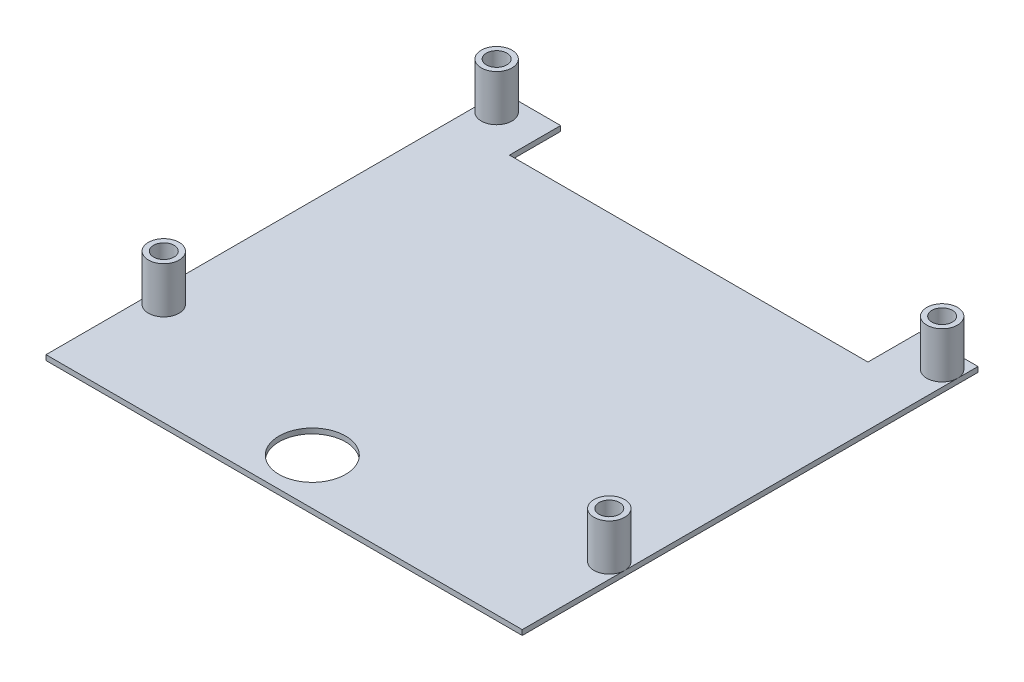
ISO-10303-21;
HEADER;
FILE_DESCRIPTION(('STEP AP214'),'2;1');
FILE_NAME('part.step','',(''),(''),'','','');
FILE_SCHEMA(('AUTOMOTIVE_DESIGN { 1 0 10303 214 1 1 1 1 }'));
ENDSEC;
DATA;
#1=APPLICATION_CONTEXT('core data for automotive mechanical design processes');
#2=APPLICATION_PROTOCOL_DEFINITION('international standard','automotive_design',2000,#1);
#3=PRODUCT_CONTEXT('',#1,'mechanical');
#4=PRODUCT('Part','Part','',(#3));
#5=PRODUCT_RELATED_PRODUCT_CATEGORY('part','',(#4));
#6=PRODUCT_DEFINITION_FORMATION('','',#4);
#7=PRODUCT_DEFINITION_CONTEXT('part definition',#1,'design');
#8=PRODUCT_DEFINITION('design','',#6,#7);
#9=PRODUCT_DEFINITION_SHAPE('','',#8);
#10=(LENGTH_UNIT() NAMED_UNIT(*) SI_UNIT(.MILLI.,.METRE.));
#11=(NAMED_UNIT(*) PLANE_ANGLE_UNIT() SI_UNIT($,.RADIAN.));
#12=(NAMED_UNIT(*) SI_UNIT($,.STERADIAN.) SOLID_ANGLE_UNIT());
#13=UNCERTAINTY_MEASURE_WITH_UNIT(LENGTH_MEASURE(1.E-05),#10,'distance_accuracy_value','');
#14=(GEOMETRIC_REPRESENTATION_CONTEXT(3) GLOBAL_UNCERTAINTY_ASSIGNED_CONTEXT((#13)) GLOBAL_UNIT_ASSIGNED_CONTEXT((#10,
#11,#12)) REPRESENTATION_CONTEXT('',''));
#15=CARTESIAN_POINT('',(0.,0.,0.));
#16=DIRECTION('',(0.,0.,1.));
#17=DIRECTION('',(1.,0.,0.));
#18=AXIS2_PLACEMENT_3D('',#15,#16,#17);
#19=CARTESIAN_POINT('',(-46.5,1.,-44.5));
#20=DIRECTION('',(0.,0.,1.));
#21=DIRECTION('',(1.,0.,0.));
#22=AXIS2_PLACEMENT_3D('',#19,#20,#21);
#23=PLANE('',#22);
#24=DIRECTION('',(-1.,0.,0.));
#25=VECTOR('',#24,1.);
#26=CARTESIAN_POINT('',(-46.5,1.,-44.5));
#27=LINE('',#26,#25);
#28=CARTESIAN_POINT('',(-35.,1.,-44.5));
#29=VERTEX_POINT('',#28);
#30=CARTESIAN_POINT('',(-46.5,1.,-44.5));
#31=VERTEX_POINT('',#30);
#32=EDGE_CURVE('E139',#29,#31,#27,.T.);
#33=ORIENTED_EDGE('',*,*,#32,.F.);
#34=DIRECTION('',(0.,1.,0.));
#35=VECTOR('',#34,1.);
#36=CARTESIAN_POINT('',(-35.,0.,-44.5));
#37=LINE('',#36,#35);
#38=CARTESIAN_POINT('',(-35.,0.,-44.5));
#39=VERTEX_POINT('',#38);
#40=EDGE_CURVE('E125',#39,#29,#37,.T.);
#41=ORIENTED_EDGE('',*,*,#40,.F.);
#42=DIRECTION('',(-1.,0.,0.));
#43=VECTOR('',#42,1.);
#44=CARTESIAN_POINT('',(-46.5,0.,-44.5));
#45=LINE('',#44,#43);
#46=CARTESIAN_POINT('',(-46.5,0.,-44.5));
#47=VERTEX_POINT('',#46);
#48=EDGE_CURVE('E164',#39,#47,#45,.T.);
#49=ORIENTED_EDGE('',*,*,#48,.T.);
#50=DIRECTION('',(0.,-1.,0.));
#51=VECTOR('',#50,1.);
#52=CARTESIAN_POINT('',(-46.5,1.,-44.5));
#53=LINE('',#52,#51);
#54=EDGE_CURVE('E46',#31,#47,#53,.T.);
#55=ORIENTED_EDGE('',*,*,#54,.F.);
#56=EDGE_LOOP('',(#33,#41,#49,#55));
#57=FACE_BOUND('',#56,.T.);
#58=ADVANCED_FACE('F38',(#57),#23,.F.);
#59=CARTESIAN_POINT('',(46.5,1.,44.5));
#60=DIRECTION('',(-1.,0.,0.));
#61=DIRECTION('',(0.,0.,1.));
#62=AXIS2_PLACEMENT_3D('',#59,#60,#61);
#63=PLANE('',#62);
#64=DIRECTION('',(0.,0.,-1.));
#65=VECTOR('',#64,1.);
#66=CARTESIAN_POINT('',(46.5,0.,44.5));
#67=LINE('',#66,#65);
#68=CARTESIAN_POINT('',(46.5,0.,44.5));
#69=VERTEX_POINT('',#68);
#70=CARTESIAN_POINT('',(46.5,0.,-44.5));
#71=VERTEX_POINT('',#70);
#72=EDGE_CURVE('E161',#69,#71,#67,.T.);
#73=ORIENTED_EDGE('',*,*,#72,.T.);
#74=DIRECTION('',(0.,-1.,0.));
#75=VECTOR('',#74,1.);
#76=CARTESIAN_POINT('',(46.5,1.,-44.5));
#77=LINE('',#76,#75);
#78=CARTESIAN_POINT('',(46.5,1.,-44.5));
#79=VERTEX_POINT('',#78);
#80=EDGE_CURVE('E11',#79,#71,#77,.T.);
#81=ORIENTED_EDGE('',*,*,#80,.F.);
#82=DIRECTION('',(0.,0.,-1.));
#83=VECTOR('',#82,1.);
#84=CARTESIAN_POINT('',(46.5,1.,44.5));
#85=LINE('',#84,#83);
#86=CARTESIAN_POINT('',(46.5,1.,-40.5));
#87=VERTEX_POINT('',#86);
#88=EDGE_CURVE('E90',#87,#79,#85,.T.);
#89=ORIENTED_EDGE('',*,*,#88,.F.);
#90=CARTESIAN_POINT('',(46.5,1.,24.5));
#91=VERTEX_POINT('',#90);
#92=EDGE_CURVE('E152',#91,#87,#85,.T.);
#93=ORIENTED_EDGE('',*,*,#92,.F.);
#94=CARTESIAN_POINT('',(46.5,1.,44.5));
#95=VERTEX_POINT('',#94);
#96=EDGE_CURVE('E149',#95,#91,#85,.T.);
#97=ORIENTED_EDGE('',*,*,#96,.F.);
#98=DIRECTION('',(0.,-1.,0.));
#99=VECTOR('',#98,1.);
#100=CARTESIAN_POINT('',(46.5,1.,44.5));
#101=LINE('',#100,#99);
#102=EDGE_CURVE('E160',#95,#69,#101,.T.);
#103=ORIENTED_EDGE('',*,*,#102,.T.);
#104=EDGE_LOOP('',(#73,#81,#89,#93,#97,#103));
#105=FACE_BOUND('',#104,.T.);
#106=ADVANCED_FACE('F40',(#105),#63,.F.);
#107=CARTESIAN_POINT('',(35.,0.,-44.5));
#108=VERTEX_POINT('',#107);
#109=EDGE_CURVE('E166',#71,#108,#45,.T.);
#110=ORIENTED_EDGE('',*,*,#109,.T.);
#111=DIRECTION('',(0.,1.,0.));
#112=VECTOR('',#111,1.);
#113=CARTESIAN_POINT('',(35.,0.,-44.5));
#114=LINE('',#113,#112);
#115=CARTESIAN_POINT('',(35.,1.,-44.5));
#116=VERTEX_POINT('',#115);
#117=EDGE_CURVE('E135',#108,#116,#114,.T.);
#118=ORIENTED_EDGE('',*,*,#117,.T.);
#119=EDGE_CURVE('E148',#79,#116,#27,.T.);
#120=ORIENTED_EDGE('',*,*,#119,.F.);
#121=ORIENTED_EDGE('',*,*,#80,.T.);
#122=EDGE_LOOP('',(#110,#118,#120,#121));
#123=FACE_BOUND('',#122,.T.);
#124=ADVANCED_FACE('F229',(#123),#23,.F.);
#125=CARTESIAN_POINT('',(-46.5,1.,44.5));
#126=DIRECTION('',(1.,0.,0.));
#127=DIRECTION('',(0.,0.,-1.));
#128=AXIS2_PLACEMENT_3D('',#125,#126,#127);
#129=PLANE('',#128);
#130=DIRECTION('',(0.,0.,1.));
#131=VECTOR('',#130,1.);
#132=CARTESIAN_POINT('',(-46.5,0.,44.5));
#133=LINE('',#132,#131);
#134=CARTESIAN_POINT('',(-46.5,0.,44.5));
#135=VERTEX_POINT('',#134);
#136=EDGE_CURVE('E169',#47,#135,#133,.T.);
#137=ORIENTED_EDGE('',*,*,#136,.T.);
#138=DIRECTION('',(0.,-1.,0.));
#139=VECTOR('',#138,1.);
#140=CARTESIAN_POINT('',(-46.5,1.,44.5));
#141=LINE('',#140,#139);
#142=CARTESIAN_POINT('',(-46.5,1.,44.5));
#143=VERTEX_POINT('',#142);
#144=EDGE_CURVE('E173',#143,#135,#141,.T.);
#145=ORIENTED_EDGE('',*,*,#144,.F.);
#146=DIRECTION('',(0.,0.,1.));
#147=VECTOR('',#146,1.);
#148=CARTESIAN_POINT('',(-46.5,1.,44.5));
#149=LINE('',#148,#147);
#150=CARTESIAN_POINT('',(-46.5,1.,24.5));
#151=VERTEX_POINT('',#150);
#152=EDGE_CURVE('E151',#151,#143,#149,.T.);
#153=ORIENTED_EDGE('',*,*,#152,.F.);
#154=CARTESIAN_POINT('',(-46.5,1.,-40.5));
#155=VERTEX_POINT('',#154);
#156=EDGE_CURVE('E158',#155,#151,#149,.T.);
#157=ORIENTED_EDGE('',*,*,#156,.F.);
#158=EDGE_CURVE('E156',#31,#155,#149,.T.);
#159=ORIENTED_EDGE('',*,*,#158,.F.);
#160=ORIENTED_EDGE('',*,*,#54,.T.);
#161=EDGE_LOOP('',(#137,#145,#153,#157,#159,#160));
#162=FACE_BOUND('',#161,.T.);
#163=ADVANCED_FACE('F176',(#162),#129,.F.);
#164=CARTESIAN_POINT('',(-46.5,1.,44.5));
#165=DIRECTION('',(0.,0.,-1.));
#166=DIRECTION('',(-1.,0.,0.));
#167=AXIS2_PLACEMENT_3D('',#164,#165,#166);
#168=PLANE('',#167);
#169=DIRECTION('',(1.,0.,0.));
#170=VECTOR('',#169,1.);
#171=CARTESIAN_POINT('',(-46.5,0.,44.5));
#172=LINE('',#171,#170);
#173=EDGE_CURVE('E83',#135,#69,#172,.T.);
#174=ORIENTED_EDGE('',*,*,#173,.T.);
#175=ORIENTED_EDGE('',*,*,#102,.F.);
#176=DIRECTION('',(1.,0.,0.));
#177=VECTOR('',#176,1.);
#178=CARTESIAN_POINT('',(-46.5,1.,44.5));
#179=LINE('',#178,#177);
#180=EDGE_CURVE('E62',#143,#95,#179,.T.);
#181=ORIENTED_EDGE('',*,*,#180,.F.);
#182=ORIENTED_EDGE('',*,*,#144,.T.);
#183=EDGE_LOOP('',(#174,#175,#181,#182));
#184=FACE_BOUND('',#183,.T.);
#185=ADVANCED_FACE('F186',(#184),#168,.F.);
#186=CARTESIAN_POINT('',(0.,1.,0.));
#187=DIRECTION('',(0.,-1.,0.));
#188=DIRECTION('',(0.,0.,-1.));
#189=AXIS2_PLACEMENT_3D('',#186,#187,#188);
#190=PLANE('',#189);
#191=CARTESIAN_POINT('',(-3.50000000000001,1.,35.5));
#192=DIRECTION('',(0.,1.,0.));
#193=DIRECTION('',(0.,0.,1.));
#194=AXIS2_PLACEMENT_3D('',#191,#192,#193);
#195=CIRCLE('',#194,6.5);
#196=CARTESIAN_POINT('',(-3.50000000000001,1.,42.));
#197=VERTEX_POINT('',#196);
#198=EDGE_CURVE('E144',#197,#197,#195,.T.);
#199=ORIENTED_EDGE('',*,*,#198,.F.);
#200=EDGE_LOOP('',(#199));
#201=FACE_BOUND('',#200,.T.);
#202=DIRECTION('',(1.,0.,0.));
#203=VECTOR('',#202,1.);
#204=CARTESIAN_POINT('',(-35.,1.,-34.5));
#205=LINE('',#204,#203);
#206=CARTESIAN_POINT('',(-35.,1.,-34.5));
#207=VERTEX_POINT('',#206);
#208=CARTESIAN_POINT('',(35.,1.,-34.5));
#209=VERTEX_POINT('',#208);
#210=EDGE_CURVE('E143',#207,#209,#205,.T.);
#211=ORIENTED_EDGE('',*,*,#210,.F.);
#212=DIRECTION('',(0.,0.,1.));
#213=VECTOR('',#212,1.);
#214=CARTESIAN_POINT('',(-35.,1.,-34.5));
#215=LINE('',#214,#213);
#216=EDGE_CURVE('E128',#29,#207,#215,.T.);
#217=ORIENTED_EDGE('',*,*,#216,.F.);
#218=ORIENTED_EDGE('',*,*,#32,.T.);
#219=ORIENTED_EDGE('',*,*,#158,.T.);
#220=CARTESIAN_POINT('',(-43.5,1.,-40.5));
#221=DIRECTION('',(0.,1.,0.));
#222=DIRECTION('',(0.,0.,1.));
#223=AXIS2_PLACEMENT_3D('',#220,#221,#222);
#224=CIRCLE('',#223,3.);
#225=EDGE_CURVE('E207',#155,#155,#224,.T.);
#226=ORIENTED_EDGE('',*,*,#225,.F.);
#227=ORIENTED_EDGE('',*,*,#156,.T.);
#228=CARTESIAN_POINT('',(-43.5,1.,24.5));
#229=DIRECTION('',(0.,1.,0.));
#230=DIRECTION('',(0.,0.,1.));
#231=AXIS2_PLACEMENT_3D('',#228,#229,#230);
#232=CIRCLE('',#231,3.);
#233=EDGE_CURVE('E191',#151,#151,#232,.T.);
#234=ORIENTED_EDGE('',*,*,#233,.F.);
#235=ORIENTED_EDGE('',*,*,#152,.T.);
#236=ORIENTED_EDGE('',*,*,#180,.T.);
#237=ORIENTED_EDGE('',*,*,#96,.T.);
#238=CARTESIAN_POINT('',(43.5,1.,24.5));
#239=DIRECTION('',(0.,1.,0.));
#240=DIRECTION('',(0.,0.,1.));
#241=AXIS2_PLACEMENT_3D('',#238,#239,#240);
#242=CIRCLE('',#241,3.);
#243=EDGE_CURVE('E200',#91,#91,#242,.T.);
#244=ORIENTED_EDGE('',*,*,#243,.F.);
#245=ORIENTED_EDGE('',*,*,#92,.T.);
#246=CARTESIAN_POINT('',(43.5,1.,-40.5));
#247=DIRECTION('',(0.,1.,0.));
#248=DIRECTION('',(0.,0.,1.));
#249=AXIS2_PLACEMENT_3D('',#246,#247,#248);
#250=CIRCLE('',#249,3.);
#251=EDGE_CURVE('E197',#87,#87,#250,.T.);
#252=ORIENTED_EDGE('',*,*,#251,.F.);
#253=ORIENTED_EDGE('',*,*,#88,.T.);
#254=ORIENTED_EDGE('',*,*,#119,.T.);
#255=DIRECTION('',(0.,0.,-1.));
#256=VECTOR('',#255,1.);
#257=CARTESIAN_POINT('',(35.,1.,-34.5));
#258=LINE('',#257,#256);
#259=EDGE_CURVE('E240',#209,#116,#258,.T.);
#260=ORIENTED_EDGE('',*,*,#259,.F.);
#261=EDGE_LOOP('',(#211,#217,#218,#219,#226,#227,#234,#235,#236,#237,#244,#245,#252,#253,#254,#260));
#262=FACE_BOUND('',#261,.T.);
#263=ADVANCED_FACE('F138',(#201,#262),#190,.F.);
#264=CARTESIAN_POINT('',(0.,0.,0.));
#265=DIRECTION('',(0.,-1.,0.));
#266=DIRECTION('',(0.,0.,-1.));
#267=AXIS2_PLACEMENT_3D('',#264,#265,#266);
#268=PLANE('',#267);
#269=CARTESIAN_POINT('',(-43.5,0.,24.5));
#270=DIRECTION('',(0.,1.,0.));
#271=DIRECTION('',(0.,0.,1.));
#272=AXIS2_PLACEMENT_3D('',#269,#270,#271);
#273=CIRCLE('',#272,2.);
#274=CARTESIAN_POINT('',(-43.5,0.,26.5));
#275=VERTEX_POINT('',#274);
#276=EDGE_CURVE('E317',#275,#275,#273,.T.);
#277=ORIENTED_EDGE('',*,*,#276,.T.);
#278=EDGE_LOOP('',(#277));
#279=FACE_BOUND('',#278,.T.);
#280=CARTESIAN_POINT('',(43.5,0.,-40.5));
#281=DIRECTION('',(0.,1.,0.));
#282=DIRECTION('',(0.,0.,1.));
#283=AXIS2_PLACEMENT_3D('',#280,#281,#282);
#284=CIRCLE('',#283,2.);
#285=CARTESIAN_POINT('',(43.5,0.,-38.5));
#286=VERTEX_POINT('',#285);
#287=EDGE_CURVE('E318',#286,#286,#284,.T.);
#288=ORIENTED_EDGE('',*,*,#287,.T.);
#289=EDGE_LOOP('',(#288));
#290=FACE_BOUND('',#289,.T.);
#291=CARTESIAN_POINT('',(43.5,0.,24.5));
#292=DIRECTION('',(0.,1.,0.));
#293=DIRECTION('',(0.,0.,1.));
#294=AXIS2_PLACEMENT_3D('',#291,#292,#293);
#295=CIRCLE('',#294,2.);
#296=CARTESIAN_POINT('',(43.5,0.,26.5));
#297=VERTEX_POINT('',#296);
#298=EDGE_CURVE('E337',#297,#297,#295,.T.);
#299=ORIENTED_EDGE('',*,*,#298,.T.);
#300=EDGE_LOOP('',(#299));
#301=FACE_BOUND('',#300,.T.);
#302=CARTESIAN_POINT('',(-43.5,0.,-40.5));
#303=DIRECTION('',(0.,1.,0.));
#304=DIRECTION('',(0.,0.,1.));
#305=AXIS2_PLACEMENT_3D('',#302,#303,#304);
#306=CIRCLE('',#305,2.);
#307=CARTESIAN_POINT('',(-43.5,0.,-38.5));
#308=VERTEX_POINT('',#307);
#309=EDGE_CURVE('E136',#308,#308,#306,.T.);
#310=ORIENTED_EDGE('',*,*,#309,.T.);
#311=EDGE_LOOP('',(#310));
#312=FACE_BOUND('',#311,.T.);
#313=CARTESIAN_POINT('',(-3.50000000000001,0.,35.5));
#314=DIRECTION('',(0.,1.,0.));
#315=DIRECTION('',(0.,0.,1.));
#316=AXIS2_PLACEMENT_3D('',#313,#314,#315);
#317=CIRCLE('',#316,6.5);
#318=CARTESIAN_POINT('',(-3.50000000000001,0.,42.));
#319=VERTEX_POINT('',#318);
#320=EDGE_CURVE('E254',#319,#319,#317,.T.);
#321=ORIENTED_EDGE('',*,*,#320,.T.);
#322=EDGE_LOOP('',(#321));
#323=FACE_BOUND('',#322,.T.);
#324=DIRECTION('',(0.,0.,1.));
#325=VECTOR('',#324,1.);
#326=CARTESIAN_POINT('',(-35.,0.,-34.5));
#327=LINE('',#326,#325);
#328=CARTESIAN_POINT('',(-35.,0.,-34.5));
#329=VERTEX_POINT('',#328);
#330=EDGE_CURVE('E131',#39,#329,#327,.T.);
#331=ORIENTED_EDGE('',*,*,#330,.T.);
#332=DIRECTION('',(1.,0.,0.));
#333=VECTOR('',#332,1.);
#334=CARTESIAN_POINT('',(-35.,0.,-34.5));
#335=LINE('',#334,#333);
#336=CARTESIAN_POINT('',(35.,0.,-34.5));
#337=VERTEX_POINT('',#336);
#338=EDGE_CURVE('E243',#329,#337,#335,.T.);
#339=ORIENTED_EDGE('',*,*,#338,.T.);
#340=DIRECTION('',(0.,0.,-1.));
#341=VECTOR('',#340,1.);
#342=CARTESIAN_POINT('',(35.,0.,-34.5));
#343=LINE('',#342,#341);
#344=EDGE_CURVE('E53',#337,#108,#343,.T.);
#345=ORIENTED_EDGE('',*,*,#344,.T.);
#346=ORIENTED_EDGE('',*,*,#109,.F.);
#347=ORIENTED_EDGE('',*,*,#72,.F.);
#348=ORIENTED_EDGE('',*,*,#173,.F.);
#349=ORIENTED_EDGE('',*,*,#136,.F.);
#350=ORIENTED_EDGE('',*,*,#48,.F.);
#351=EDGE_LOOP('',(#331,#339,#345,#346,#347,#348,#349,#350));
#352=FACE_BOUND('',#351,.T.);
#353=ADVANCED_FACE('F180',(#279,#290,#301,#312,#323,#352),#268,.T.);
#354=CARTESIAN_POINT('',(-43.5,10.,-40.5));
#355=DIRECTION('',(0.,-1.,0.));
#356=DIRECTION('',(0.,0.,-1.));
#357=AXIS2_PLACEMENT_3D('',#354,#355,#356);
#358=CYLINDRICAL_SURFACE('',#357,3.);
#359=CARTESIAN_POINT('',(-43.5,10.,-40.5));
#360=DIRECTION('',(0.,1.,0.));
#361=DIRECTION('',(0.,0.,1.));
#362=AXIS2_PLACEMENT_3D('',#359,#360,#361);
#363=CIRCLE('',#362,3.);
#364=CARTESIAN_POINT('',(-43.5,10.,-37.5));
#365=VERTEX_POINT('',#364);
#366=EDGE_CURVE('E165',#365,#365,#363,.T.);
#367=ORIENTED_EDGE('',*,*,#366,.F.);
#368=EDGE_LOOP('',(#367));
#369=FACE_BOUND('',#368,.T.);
#370=ORIENTED_EDGE('',*,*,#225,.T.);
#371=EDGE_LOOP('',(#370));
#372=FACE_BOUND('',#371,.T.);
#373=ADVANCED_FACE('F212',(#369,#372),#358,.T.);
#374=CARTESIAN_POINT('',(-43.5,10.,-40.5));
#375=DIRECTION('',(0.,1.,0.));
#376=DIRECTION('',(0.,0.,1.));
#377=AXIS2_PLACEMENT_3D('',#374,#375,#376);
#378=PLANE('',#377);
#379=CARTESIAN_POINT('',(-43.5,10.,-40.5));
#380=DIRECTION('',(0.,1.,0.));
#381=DIRECTION('',(0.,0.,1.));
#382=AXIS2_PLACEMENT_3D('',#379,#380,#381);
#383=CIRCLE('',#382,2.);
#384=CARTESIAN_POINT('',(-43.5,10.,-38.5));
#385=VERTEX_POINT('',#384);
#386=EDGE_CURVE('E264',#385,#385,#383,.T.);
#387=ORIENTED_EDGE('',*,*,#386,.F.);
#388=EDGE_LOOP('',(#387));
#389=FACE_BOUND('',#388,.T.);
#390=ORIENTED_EDGE('',*,*,#366,.T.);
#391=EDGE_LOOP('',(#390));
#392=FACE_BOUND('',#391,.T.);
#393=ADVANCED_FACE('F214',(#389,#392),#378,.T.);
#394=CARTESIAN_POINT('',(43.5,10.,-40.5));
#395=DIRECTION('',(0.,-1.,0.));
#396=DIRECTION('',(0.,0.,-1.));
#397=AXIS2_PLACEMENT_3D('',#394,#395,#396);
#398=CYLINDRICAL_SURFACE('',#397,3.);
#399=CARTESIAN_POINT('',(43.5,10.,-40.5));
#400=DIRECTION('',(0.,1.,0.));
#401=DIRECTION('',(0.,0.,1.));
#402=AXIS2_PLACEMENT_3D('',#399,#400,#401);
#403=CIRCLE('',#402,3.);
#404=CARTESIAN_POINT('',(43.5,10.,-37.5));
#405=VERTEX_POINT('',#404);
#406=EDGE_CURVE('E193',#405,#405,#403,.T.);
#407=ORIENTED_EDGE('',*,*,#406,.F.);
#408=EDGE_LOOP('',(#407));
#409=FACE_BOUND('',#408,.T.);
#410=ORIENTED_EDGE('',*,*,#251,.T.);
#411=EDGE_LOOP('',(#410));
#412=FACE_BOUND('',#411,.T.);
#413=ADVANCED_FACE('F221',(#409,#412),#398,.T.);
#414=CARTESIAN_POINT('',(43.5,10.,-40.5));
#415=DIRECTION('',(0.,1.,0.));
#416=DIRECTION('',(0.,0.,1.));
#417=AXIS2_PLACEMENT_3D('',#414,#415,#416);
#418=PLANE('',#417);
#419=CARTESIAN_POINT('',(43.5,10.,-40.5));
#420=DIRECTION('',(0.,1.,0.));
#421=DIRECTION('',(0.,0.,1.));
#422=AXIS2_PLACEMENT_3D('',#419,#420,#421);
#423=CIRCLE('',#422,2.);
#424=CARTESIAN_POINT('',(43.5,10.,-38.5));
#425=VERTEX_POINT('',#424);
#426=EDGE_CURVE('E313',#425,#425,#423,.T.);
#427=ORIENTED_EDGE('',*,*,#426,.F.);
#428=EDGE_LOOP('',(#427));
#429=FACE_BOUND('',#428,.T.);
#430=ORIENTED_EDGE('',*,*,#406,.T.);
#431=EDGE_LOOP('',(#430));
#432=FACE_BOUND('',#431,.T.);
#433=ADVANCED_FACE('F298',(#429,#432),#418,.T.);
#434=CARTESIAN_POINT('',(-43.5,10.,24.5));
#435=DIRECTION('',(0.,-1.,0.));
#436=DIRECTION('',(0.,0.,-1.));
#437=AXIS2_PLACEMENT_3D('',#434,#435,#436);
#438=CYLINDRICAL_SURFACE('',#437,3.);
#439=CARTESIAN_POINT('',(-43.5,10.,24.5));
#440=DIRECTION('',(0.,1.,0.));
#441=DIRECTION('',(0.,0.,1.));
#442=AXIS2_PLACEMENT_3D('',#439,#440,#441);
#443=CIRCLE('',#442,3.);
#444=CARTESIAN_POINT('',(-43.5,10.,27.5));
#445=VERTEX_POINT('',#444);
#446=EDGE_CURVE('E194',#445,#445,#443,.T.);
#447=ORIENTED_EDGE('',*,*,#446,.F.);
#448=EDGE_LOOP('',(#447));
#449=FACE_BOUND('',#448,.T.);
#450=ORIENTED_EDGE('',*,*,#233,.T.);
#451=EDGE_LOOP('',(#450));
#452=FACE_BOUND('',#451,.T.);
#453=ADVANCED_FACE('F295',(#449,#452),#438,.T.);
#454=CARTESIAN_POINT('',(-43.5,10.,24.5));
#455=DIRECTION('',(0.,1.,0.));
#456=DIRECTION('',(0.,0.,1.));
#457=AXIS2_PLACEMENT_3D('',#454,#455,#456);
#458=PLANE('',#457);
#459=CARTESIAN_POINT('',(-43.5,10.,24.5));
#460=DIRECTION('',(0.,1.,0.));
#461=DIRECTION('',(0.,0.,1.));
#462=AXIS2_PLACEMENT_3D('',#459,#460,#461);
#463=CIRCLE('',#462,2.);
#464=CARTESIAN_POINT('',(-43.5,10.,26.5));
#465=VERTEX_POINT('',#464);
#466=EDGE_CURVE('E321',#465,#465,#463,.T.);
#467=ORIENTED_EDGE('',*,*,#466,.F.);
#468=EDGE_LOOP('',(#467));
#469=FACE_BOUND('',#468,.T.);
#470=ORIENTED_EDGE('',*,*,#446,.T.);
#471=EDGE_LOOP('',(#470));
#472=FACE_BOUND('',#471,.T.);
#473=ADVANCED_FACE('F290',(#469,#472),#458,.T.);
#474=CARTESIAN_POINT('',(43.5,10.,24.5));
#475=DIRECTION('',(0.,-1.,0.));
#476=DIRECTION('',(0.,0.,-1.));
#477=AXIS2_PLACEMENT_3D('',#474,#475,#476);
#478=CYLINDRICAL_SURFACE('',#477,3.);
#479=CARTESIAN_POINT('',(43.5,10.,24.5));
#480=DIRECTION('',(0.,1.,0.));
#481=DIRECTION('',(0.,0.,1.));
#482=AXIS2_PLACEMENT_3D('',#479,#480,#481);
#483=CIRCLE('',#482,3.);
#484=CARTESIAN_POINT('',(43.5,10.,27.5));
#485=VERTEX_POINT('',#484);
#486=EDGE_CURVE('E203',#485,#485,#483,.T.);
#487=ORIENTED_EDGE('',*,*,#486,.F.);
#488=EDGE_LOOP('',(#487));
#489=FACE_BOUND('',#488,.T.);
#490=ORIENTED_EDGE('',*,*,#243,.T.);
#491=EDGE_LOOP('',(#490));
#492=FACE_BOUND('',#491,.T.);
#493=ADVANCED_FACE('F286',(#489,#492),#478,.T.);
#494=CARTESIAN_POINT('',(43.5,10.,24.5));
#495=DIRECTION('',(0.,1.,0.));
#496=DIRECTION('',(0.,0.,1.));
#497=AXIS2_PLACEMENT_3D('',#494,#495,#496);
#498=PLANE('',#497);
#499=CARTESIAN_POINT('',(43.5,10.,24.5));
#500=DIRECTION('',(0.,1.,0.));
#501=DIRECTION('',(0.,0.,1.));
#502=AXIS2_PLACEMENT_3D('',#499,#500,#501);
#503=CIRCLE('',#502,2.);
#504=CARTESIAN_POINT('',(43.5,10.,26.5));
#505=VERTEX_POINT('',#504);
#506=EDGE_CURVE('E324',#505,#505,#503,.T.);
#507=ORIENTED_EDGE('',*,*,#506,.F.);
#508=EDGE_LOOP('',(#507));
#509=FACE_BOUND('',#508,.T.);
#510=ORIENTED_EDGE('',*,*,#486,.T.);
#511=EDGE_LOOP('',(#510));
#512=FACE_BOUND('',#511,.T.);
#513=ADVANCED_FACE('F289',(#509,#512),#498,.T.);
#514=CARTESIAN_POINT('',(-35.,0.,-34.5));
#515=DIRECTION('',(-1.,0.,0.));
#516=DIRECTION('',(0.,0.,1.));
#517=AXIS2_PLACEMENT_3D('',#514,#515,#516);
#518=PLANE('',#517);
#519=ORIENTED_EDGE('',*,*,#216,.T.);
#520=DIRECTION('',(0.,1.,0.));
#521=VECTOR('',#520,1.);
#522=CARTESIAN_POINT('',(-35.,0.,-34.5));
#523=LINE('',#522,#521);
#524=EDGE_CURVE('E248',#329,#207,#523,.T.);
#525=ORIENTED_EDGE('',*,*,#524,.F.);
#526=ORIENTED_EDGE('',*,*,#330,.F.);
#527=ORIENTED_EDGE('',*,*,#40,.T.);
#528=EDGE_LOOP('',(#519,#525,#526,#527));
#529=FACE_BOUND('',#528,.T.);
#530=ADVANCED_FACE('F127',(#529),#518,.F.);
#531=CARTESIAN_POINT('',(35.,0.,-34.5));
#532=DIRECTION('',(1.,0.,0.));
#533=DIRECTION('',(0.,0.,-1.));
#534=AXIS2_PLACEMENT_3D('',#531,#532,#533);
#535=PLANE('',#534);
#536=ORIENTED_EDGE('',*,*,#259,.T.);
#537=ORIENTED_EDGE('',*,*,#117,.F.);
#538=ORIENTED_EDGE('',*,*,#344,.F.);
#539=DIRECTION('',(0.,1.,0.));
#540=VECTOR('',#539,1.);
#541=CARTESIAN_POINT('',(35.,0.,-34.5));
#542=LINE('',#541,#540);
#543=EDGE_CURVE('E268',#337,#209,#542,.T.);
#544=ORIENTED_EDGE('',*,*,#543,.T.);
#545=EDGE_LOOP('',(#536,#537,#538,#544));
#546=FACE_BOUND('',#545,.T.);
#547=ADVANCED_FACE('F269',(#546),#535,.F.);
#548=CARTESIAN_POINT('',(-35.,0.,-34.5));
#549=DIRECTION('',(0.,0.,1.));
#550=DIRECTION('',(1.,0.,0.));
#551=AXIS2_PLACEMENT_3D('',#548,#549,#550);
#552=PLANE('',#551);
#553=ORIENTED_EDGE('',*,*,#210,.T.);
#554=ORIENTED_EDGE('',*,*,#543,.F.);
#555=ORIENTED_EDGE('',*,*,#338,.F.);
#556=ORIENTED_EDGE('',*,*,#524,.T.);
#557=EDGE_LOOP('',(#553,#554,#555,#556));
#558=FACE_BOUND('',#557,.T.);
#559=ADVANCED_FACE('F272',(#558),#552,.F.);
#560=CARTESIAN_POINT('',(-3.50000000000001,0.,35.5));
#561=DIRECTION('',(0.,1.,0.));
#562=DIRECTION('',(0.,0.,1.));
#563=AXIS2_PLACEMENT_3D('',#560,#561,#562);
#564=CYLINDRICAL_SURFACE('',#563,6.5);
#565=ORIENTED_EDGE('',*,*,#320,.F.);
#566=EDGE_LOOP('',(#565));
#567=FACE_BOUND('',#566,.T.);
#568=ORIENTED_EDGE('',*,*,#198,.T.);
#569=EDGE_LOOP('',(#568));
#570=FACE_BOUND('',#569,.T.);
#571=ADVANCED_FACE('F274',(#567,#570),#564,.F.);
#572=CARTESIAN_POINT('',(43.5,0.,24.5));
#573=DIRECTION('',(0.,1.,0.));
#574=DIRECTION('',(0.,0.,1.));
#575=AXIS2_PLACEMENT_3D('',#572,#573,#574);
#576=CYLINDRICAL_SURFACE('',#575,2.);
#577=ORIENTED_EDGE('',*,*,#298,.F.);
#578=EDGE_LOOP('',(#577));
#579=FACE_BOUND('',#578,.T.);
#580=ORIENTED_EDGE('',*,*,#506,.T.);
#581=EDGE_LOOP('',(#580));
#582=FACE_BOUND('',#581,.T.);
#583=ADVANCED_FACE('F280',(#579,#582),#576,.F.);
#584=CARTESIAN_POINT('',(-43.5,0.,24.5));
#585=DIRECTION('',(0.,1.,0.));
#586=DIRECTION('',(0.,0.,1.));
#587=AXIS2_PLACEMENT_3D('',#584,#585,#586);
#588=CYLINDRICAL_SURFACE('',#587,2.);
#589=ORIENTED_EDGE('',*,*,#276,.F.);
#590=EDGE_LOOP('',(#589));
#591=FACE_BOUND('',#590,.T.);
#592=ORIENTED_EDGE('',*,*,#466,.T.);
#593=EDGE_LOOP('',(#592));
#594=FACE_BOUND('',#593,.T.);
#595=ADVANCED_FACE('F344',(#591,#594),#588,.F.);
#596=CARTESIAN_POINT('',(43.5,0.,-40.5));
#597=DIRECTION('',(0.,1.,0.));
#598=DIRECTION('',(0.,0.,1.));
#599=AXIS2_PLACEMENT_3D('',#596,#597,#598);
#600=CYLINDRICAL_SURFACE('',#599,2.);
#601=ORIENTED_EDGE('',*,*,#287,.F.);
#602=EDGE_LOOP('',(#601));
#603=FACE_BOUND('',#602,.T.);
#604=ORIENTED_EDGE('',*,*,#426,.T.);
#605=EDGE_LOOP('',(#604));
#606=FACE_BOUND('',#605,.T.);
#607=ADVANCED_FACE('F350',(#603,#606),#600,.F.);
#608=CARTESIAN_POINT('',(-43.5,0.,-40.5));
#609=DIRECTION('',(0.,1.,0.));
#610=DIRECTION('',(0.,0.,1.));
#611=AXIS2_PLACEMENT_3D('',#608,#609,#610);
#612=CYLINDRICAL_SURFACE('',#611,2.);
#613=ORIENTED_EDGE('',*,*,#309,.F.);
#614=EDGE_LOOP('',(#613));
#615=FACE_BOUND('',#614,.T.);
#616=ORIENTED_EDGE('',*,*,#386,.T.);
#617=EDGE_LOOP('',(#616));
#618=FACE_BOUND('',#617,.T.);
#619=ADVANCED_FACE('F357',(#615,#618),#612,.F.);
#620=CLOSED_SHELL('',(#58,#106,#124,#163,#185,#263,#353,#373,#393,#413,#433,#453,#473,#493,#513,
#530,#547,#559,#571,#583,#595,#607,#619));
#621=MANIFOLD_SOLID_BREP('B2',#620);
#622=ADVANCED_BREP_SHAPE_REPRESENTATION('',(#18,#621),#14);
#623=SHAPE_DEFINITION_REPRESENTATION(#9,#622);
ENDSEC;
END-ISO-10303-21;
